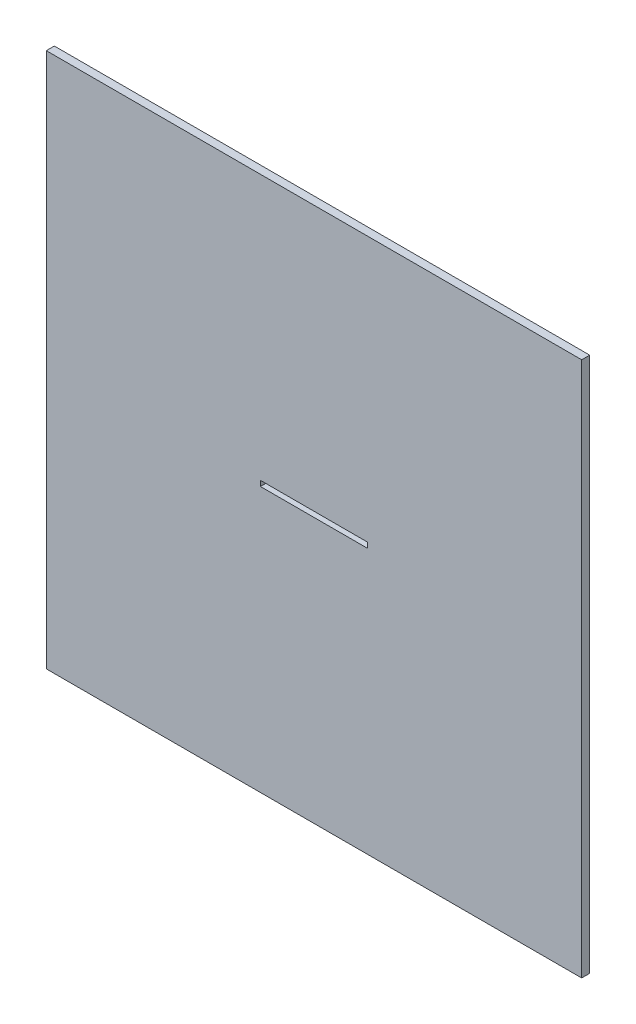
ISO-10303-21;
HEADER;
FILE_DESCRIPTION(('STEP AP214'),'2;1');
FILE_NAME('part.step','',(''),(''),'','','');
FILE_SCHEMA(('AUTOMOTIVE_DESIGN { 1 0 10303 214 1 1 1 1 }'));
ENDSEC;
DATA;
#1=APPLICATION_CONTEXT('core data for automotive mechanical design processes');
#2=APPLICATION_PROTOCOL_DEFINITION('international standard','automotive_design',2000,#1);
#3=PRODUCT_CONTEXT('',#1,'mechanical');
#4=PRODUCT('Part','Part','',(#3));
#5=PRODUCT_RELATED_PRODUCT_CATEGORY('part','',(#4));
#6=PRODUCT_DEFINITION_FORMATION('','',#4);
#7=PRODUCT_DEFINITION_CONTEXT('part definition',#1,'design');
#8=PRODUCT_DEFINITION('design','',#6,#7);
#9=PRODUCT_DEFINITION_SHAPE('','',#8);
#10=(LENGTH_UNIT() NAMED_UNIT(*) SI_UNIT(.MILLI.,.METRE.));
#11=(NAMED_UNIT(*) PLANE_ANGLE_UNIT() SI_UNIT($,.RADIAN.));
#12=(NAMED_UNIT(*) SI_UNIT($,.STERADIAN.) SOLID_ANGLE_UNIT());
#13=UNCERTAINTY_MEASURE_WITH_UNIT(LENGTH_MEASURE(1.E-05),#10,'distance_accuracy_value','');
#14=(GEOMETRIC_REPRESENTATION_CONTEXT(3) GLOBAL_UNCERTAINTY_ASSIGNED_CONTEXT((#13)) GLOBAL_UNIT_ASSIGNED_CONTEXT((#10,
#11,#12)) REPRESENTATION_CONTEXT('',''));
#15=CARTESIAN_POINT('',(0.,0.,0.));
#16=DIRECTION('',(0.,0.,1.));
#17=DIRECTION('',(1.,0.,0.));
#18=AXIS2_PLACEMENT_3D('',#15,#16,#17);
#19=CARTESIAN_POINT('',(-500.,-500.,15.));
#20=DIRECTION('',(1.,0.,0.));
#21=DIRECTION('',(0.,0.,-1.));
#22=AXIS2_PLACEMENT_3D('',#19,#20,#21);
#23=PLANE('',#22);
#24=DIRECTION('',(0.,-1.,0.));
#25=VECTOR('',#24,1.);
#26=CARTESIAN_POINT('',(-500.,-500.,0.));
#27=LINE('',#26,#25);
#28=CARTESIAN_POINT('',(-500.,500.,0.));
#29=VERTEX_POINT('',#28);
#30=CARTESIAN_POINT('',(-500.,-500.,0.));
#31=VERTEX_POINT('',#30);
#32=EDGE_CURVE('E130',#29,#31,#27,.T.);
#33=ORIENTED_EDGE('',*,*,#32,.T.);
#34=DIRECTION('',(0.,0.,-1.));
#35=VECTOR('',#34,1.);
#36=CARTESIAN_POINT('',(-500.,-500.,15.));
#37=LINE('',#36,#35);
#38=CARTESIAN_POINT('',(-500.,-500.,15.));
#39=VERTEX_POINT('',#38);
#40=EDGE_CURVE('E11',#39,#31,#37,.T.);
#41=ORIENTED_EDGE('',*,*,#40,.F.);
#42=DIRECTION('',(0.,-1.,0.));
#43=VECTOR('',#42,1.);
#44=CARTESIAN_POINT('',(-500.,-500.,15.));
#45=LINE('',#44,#43);
#46=CARTESIAN_POINT('',(-500.,500.,15.));
#47=VERTEX_POINT('',#46);
#48=EDGE_CURVE('E134',#47,#39,#45,.T.);
#49=ORIENTED_EDGE('',*,*,#48,.F.);
#50=DIRECTION('',(0.,0.,-1.));
#51=VECTOR('',#50,1.);
#52=CARTESIAN_POINT('',(-500.,500.,15.));
#53=LINE('',#52,#51);
#54=EDGE_CURVE('E144',#47,#29,#53,.T.);
#55=ORIENTED_EDGE('',*,*,#54,.T.);
#56=EDGE_LOOP('',(#33,#41,#49,#55));
#57=FACE_BOUND('',#56,.T.);
#58=ADVANCED_FACE('F33',(#57),#23,.F.);
#59=CARTESIAN_POINT('',(500.,-500.,15.));
#60=DIRECTION('',(0.,1.,0.));
#61=DIRECTION('',(-1.,0.,0.));
#62=AXIS2_PLACEMENT_3D('',#59,#60,#61);
#63=PLANE('',#62);
#64=DIRECTION('',(1.,0.,0.));
#65=VECTOR('',#64,1.);
#66=CARTESIAN_POINT('',(500.,-500.,0.));
#67=LINE('',#66,#65);
#68=CARTESIAN_POINT('',(500.,-500.,0.));
#69=VERTEX_POINT('',#68);
#70=EDGE_CURVE('E147',#31,#69,#67,.T.);
#71=ORIENTED_EDGE('',*,*,#70,.T.);
#72=DIRECTION('',(0.,0.,-1.));
#73=VECTOR('',#72,1.);
#74=CARTESIAN_POINT('',(500.,-500.,15.));
#75=LINE('',#74,#73);
#76=CARTESIAN_POINT('',(500.,-500.,15.));
#77=VERTEX_POINT('',#76);
#78=EDGE_CURVE('E40',#77,#69,#75,.T.);
#79=ORIENTED_EDGE('',*,*,#78,.F.);
#80=DIRECTION('',(1.,0.,0.));
#81=VECTOR('',#80,1.);
#82=CARTESIAN_POINT('',(500.,-500.,15.));
#83=LINE('',#82,#81);
#84=EDGE_CURVE('E137',#39,#77,#83,.T.);
#85=ORIENTED_EDGE('',*,*,#84,.F.);
#86=ORIENTED_EDGE('',*,*,#40,.T.);
#87=EDGE_LOOP('',(#71,#79,#85,#86));
#88=FACE_BOUND('',#87,.T.);
#89=ADVANCED_FACE('F175',(#88),#63,.F.);
#90=CARTESIAN_POINT('',(500.,-500.,15.));
#91=DIRECTION('',(-1.,0.,0.));
#92=DIRECTION('',(0.,0.,1.));
#93=AXIS2_PLACEMENT_3D('',#90,#91,#92);
#94=PLANE('',#93);
#95=DIRECTION('',(0.,1.,0.));
#96=VECTOR('',#95,1.);
#97=CARTESIAN_POINT('',(500.,-500.,0.));
#98=LINE('',#97,#96);
#99=CARTESIAN_POINT('',(500.,500.,0.));
#100=VERTEX_POINT('',#99);
#101=EDGE_CURVE('E149',#69,#100,#98,.T.);
#102=ORIENTED_EDGE('',*,*,#101,.T.);
#103=DIRECTION('',(0.,0.,-1.));
#104=VECTOR('',#103,1.);
#105=CARTESIAN_POINT('',(500.,500.,15.));
#106=LINE('',#105,#104);
#107=CARTESIAN_POINT('',(500.,500.,15.));
#108=VERTEX_POINT('',#107);
#109=EDGE_CURVE('E154',#108,#100,#106,.T.);
#110=ORIENTED_EDGE('',*,*,#109,.F.);
#111=DIRECTION('',(0.,1.,0.));
#112=VECTOR('',#111,1.);
#113=CARTESIAN_POINT('',(500.,-500.,15.));
#114=LINE('',#113,#112);
#115=EDGE_CURVE('E140',#77,#108,#114,.T.);
#116=ORIENTED_EDGE('',*,*,#115,.F.);
#117=ORIENTED_EDGE('',*,*,#78,.T.);
#118=EDGE_LOOP('',(#102,#110,#116,#117));
#119=FACE_BOUND('',#118,.T.);
#120=ADVANCED_FACE('F161',(#119),#94,.F.);
#121=CARTESIAN_POINT('',(500.,500.,15.));
#122=DIRECTION('',(0.,-1.,0.));
#123=DIRECTION('',(1.,0.,0.));
#124=AXIS2_PLACEMENT_3D('',#121,#122,#123);
#125=PLANE('',#124);
#126=DIRECTION('',(-1.,0.,0.));
#127=VECTOR('',#126,1.);
#128=CARTESIAN_POINT('',(500.,500.,0.));
#129=LINE('',#128,#127);
#130=EDGE_CURVE('E138',#100,#29,#129,.T.);
#131=ORIENTED_EDGE('',*,*,#130,.T.);
#132=ORIENTED_EDGE('',*,*,#54,.F.);
#133=DIRECTION('',(-1.,0.,0.));
#134=VECTOR('',#133,1.);
#135=CARTESIAN_POINT('',(500.,500.,15.));
#136=LINE('',#135,#134);
#137=EDGE_CURVE('E142',#108,#47,#136,.T.);
#138=ORIENTED_EDGE('',*,*,#137,.F.);
#139=ORIENTED_EDGE('',*,*,#109,.T.);
#140=EDGE_LOOP('',(#131,#132,#138,#139));
#141=FACE_BOUND('',#140,.T.);
#142=ADVANCED_FACE('F168',(#141),#125,.F.);
#143=CARTESIAN_POINT('',(0.,0.,15.));
#144=DIRECTION('',(0.,0.,1.));
#145=DIRECTION('',(1.,0.,0.));
#146=AXIS2_PLACEMENT_3D('',#143,#144,#145);
#147=PLANE('',#146);
#148=DIRECTION('',(0.,1.,0.));
#149=VECTOR('',#148,1.);
#150=CARTESIAN_POINT('',(100.,-5.,15.));
#151=LINE('',#150,#149);
#152=CARTESIAN_POINT('',(100.,-5.,15.));
#153=VERTEX_POINT('',#152);
#154=CARTESIAN_POINT('',(100.,5.00000000000006,15.));
#155=VERTEX_POINT('',#154);
#156=EDGE_CURVE('E47',#153,#155,#151,.T.);
#157=ORIENTED_EDGE('',*,*,#156,.F.);
#158=DIRECTION('',(1.,0.,0.));
#159=VECTOR('',#158,1.);
#160=CARTESIAN_POINT('',(100.,-5.,15.));
#161=LINE('',#160,#159);
#162=CARTESIAN_POINT('',(-100.,-5.00000000000002,15.));
#163=VERTEX_POINT('',#162);
#164=EDGE_CURVE('E115',#163,#153,#161,.T.);
#165=ORIENTED_EDGE('',*,*,#164,.F.);
#166=DIRECTION('',(0.,-1.,0.));
#167=VECTOR('',#166,1.);
#168=CARTESIAN_POINT('',(-100.,-5.00000000000002,15.));
#169=LINE('',#168,#167);
#170=CARTESIAN_POINT('',(-100.,4.99999999999998,15.));
#171=VERTEX_POINT('',#170);
#172=EDGE_CURVE('E118',#171,#163,#169,.T.);
#173=ORIENTED_EDGE('',*,*,#172,.F.);
#174=DIRECTION('',(-1.,0.,0.));
#175=VECTOR('',#174,1.);
#176=CARTESIAN_POINT('',(100.,5.00000000000006,15.));
#177=LINE('',#176,#175);
#178=EDGE_CURVE('E124',#155,#171,#177,.T.);
#179=ORIENTED_EDGE('',*,*,#178,.F.);
#180=EDGE_LOOP('',(#157,#165,#173,#179));
#181=FACE_BOUND('',#180,.T.);
#182=ORIENTED_EDGE('',*,*,#48,.T.);
#183=ORIENTED_EDGE('',*,*,#84,.T.);
#184=ORIENTED_EDGE('',*,*,#115,.T.);
#185=ORIENTED_EDGE('',*,*,#137,.T.);
#186=EDGE_LOOP('',(#182,#183,#184,#185));
#187=FACE_BOUND('',#186,.T.);
#188=ADVANCED_FACE('F174',(#181,#187),#147,.T.);
#189=CARTESIAN_POINT('',(0.,0.,0.));
#190=DIRECTION('',(0.,0.,1.));
#191=DIRECTION('',(1.,0.,0.));
#192=AXIS2_PLACEMENT_3D('',#189,#190,#191);
#193=PLANE('',#192);
#194=DIRECTION('',(1.,0.,0.));
#195=VECTOR('',#194,1.);
#196=CARTESIAN_POINT('',(100.,-5.,0.));
#197=LINE('',#196,#195);
#198=CARTESIAN_POINT('',(-100.,-5.00000000000002,0.));
#199=VERTEX_POINT('',#198);
#200=CARTESIAN_POINT('',(100.,-5.,0.));
#201=VERTEX_POINT('',#200);
#202=EDGE_CURVE('E105',#199,#201,#197,.T.);
#203=ORIENTED_EDGE('',*,*,#202,.T.);
#204=DIRECTION('',(0.,1.,0.));
#205=VECTOR('',#204,1.);
#206=CARTESIAN_POINT('',(100.,-5.,0.));
#207=LINE('',#206,#205);
#208=CARTESIAN_POINT('',(100.,5.00000000000006,0.));
#209=VERTEX_POINT('',#208);
#210=EDGE_CURVE('E99',#201,#209,#207,.T.);
#211=ORIENTED_EDGE('',*,*,#210,.T.);
#212=DIRECTION('',(-1.,0.,0.));
#213=VECTOR('',#212,1.);
#214=CARTESIAN_POINT('',(100.,5.00000000000006,0.));
#215=LINE('',#214,#213);
#216=CARTESIAN_POINT('',(-100.,4.99999999999998,0.));
#217=VERTEX_POINT('',#216);
#218=EDGE_CURVE('E108',#209,#217,#215,.T.);
#219=ORIENTED_EDGE('',*,*,#218,.T.);
#220=DIRECTION('',(0.,-1.,0.));
#221=VECTOR('',#220,1.);
#222=CARTESIAN_POINT('',(-100.,-5.00000000000002,0.));
#223=LINE('',#222,#221);
#224=EDGE_CURVE('E55',#217,#199,#223,.T.);
#225=ORIENTED_EDGE('',*,*,#224,.T.);
#226=EDGE_LOOP('',(#203,#211,#219,#225));
#227=FACE_BOUND('',#226,.T.);
#228=ORIENTED_EDGE('',*,*,#32,.F.);
#229=ORIENTED_EDGE('',*,*,#130,.F.);
#230=ORIENTED_EDGE('',*,*,#101,.F.);
#231=ORIENTED_EDGE('',*,*,#70,.F.);
#232=EDGE_LOOP('',(#228,#229,#230,#231));
#233=FACE_BOUND('',#232,.T.);
#234=ADVANCED_FACE('F112',(#227,#233),#193,.F.);
#235=CARTESIAN_POINT('',(100.,-5.,0.));
#236=DIRECTION('',(1.,0.,0.));
#237=DIRECTION('',(0.,0.,-1.));
#238=AXIS2_PLACEMENT_3D('',#235,#236,#237);
#239=PLANE('',#238);
#240=ORIENTED_EDGE('',*,*,#156,.T.);
#241=DIRECTION('',(0.,0.,1.));
#242=VECTOR('',#241,1.);
#243=CARTESIAN_POINT('',(100.,5.00000000000006,0.));
#244=LINE('',#243,#242);
#245=EDGE_CURVE('E95',#209,#155,#244,.T.);
#246=ORIENTED_EDGE('',*,*,#245,.F.);
#247=ORIENTED_EDGE('',*,*,#210,.F.);
#248=DIRECTION('',(0.,0.,1.));
#249=VECTOR('',#248,1.);
#250=CARTESIAN_POINT('',(100.,-5.,0.));
#251=LINE('',#250,#249);
#252=EDGE_CURVE('E128',#201,#153,#251,.T.);
#253=ORIENTED_EDGE('',*,*,#252,.T.);
#254=EDGE_LOOP('',(#240,#246,#247,#253));
#255=FACE_BOUND('',#254,.T.);
#256=ADVANCED_FACE('F97',(#255),#239,.F.);
#257=CARTESIAN_POINT('',(100.,-5.,0.));
#258=DIRECTION('',(0.,-1.,0.));
#259=DIRECTION('',(1.,0.,0.));
#260=AXIS2_PLACEMENT_3D('',#257,#258,#259);
#261=PLANE('',#260);
#262=ORIENTED_EDGE('',*,*,#164,.T.);
#263=ORIENTED_EDGE('',*,*,#252,.F.);
#264=ORIENTED_EDGE('',*,*,#202,.F.);
#265=DIRECTION('',(0.,0.,1.));
#266=VECTOR('',#265,1.);
#267=CARTESIAN_POINT('',(-100.,-5.00000000000002,0.));
#268=LINE('',#267,#266);
#269=EDGE_CURVE('E131',#199,#163,#268,.T.);
#270=ORIENTED_EDGE('',*,*,#269,.T.);
#271=EDGE_LOOP('',(#262,#263,#264,#270));
#272=FACE_BOUND('',#271,.T.);
#273=ADVANCED_FACE('F192',(#272),#261,.F.);
#274=CARTESIAN_POINT('',(-100.,-5.00000000000002,0.));
#275=DIRECTION('',(-1.,0.,0.));
#276=DIRECTION('',(0.,0.,1.));
#277=AXIS2_PLACEMENT_3D('',#274,#275,#276);
#278=PLANE('',#277);
#279=ORIENTED_EDGE('',*,*,#172,.T.);
#280=ORIENTED_EDGE('',*,*,#269,.F.);
#281=ORIENTED_EDGE('',*,*,#224,.F.);
#282=DIRECTION('',(0.,0.,1.));
#283=VECTOR('',#282,1.);
#284=CARTESIAN_POINT('',(-100.,4.99999999999998,0.));
#285=LINE('',#284,#283);
#286=EDGE_CURVE('E104',#217,#171,#285,.T.);
#287=ORIENTED_EDGE('',*,*,#286,.T.);
#288=EDGE_LOOP('',(#279,#280,#281,#287));
#289=FACE_BOUND('',#288,.T.);
#290=ADVANCED_FACE('F195',(#289),#278,.F.);
#291=CARTESIAN_POINT('',(100.,5.00000000000006,0.));
#292=DIRECTION('',(0.,1.,0.));
#293=DIRECTION('',(-1.,0.,0.));
#294=AXIS2_PLACEMENT_3D('',#291,#292,#293);
#295=PLANE('',#294);
#296=ORIENTED_EDGE('',*,*,#178,.T.);
#297=ORIENTED_EDGE('',*,*,#286,.F.);
#298=ORIENTED_EDGE('',*,*,#218,.F.);
#299=ORIENTED_EDGE('',*,*,#245,.T.);
#300=EDGE_LOOP('',(#296,#297,#298,#299));
#301=FACE_BOUND('',#300,.T.);
#302=ADVANCED_FACE('F109',(#301),#295,.F.);
#303=CLOSED_SHELL('',(#58,#89,#120,#142,#188,#234,#256,#273,#290,#302));
#304=MANIFOLD_SOLID_BREP('B2',#303);
#305=ADVANCED_BREP_SHAPE_REPRESENTATION('',(#18,#304),#14);
#306=SHAPE_DEFINITION_REPRESENTATION(#9,#305);
ENDSEC;
END-ISO-10303-21;
